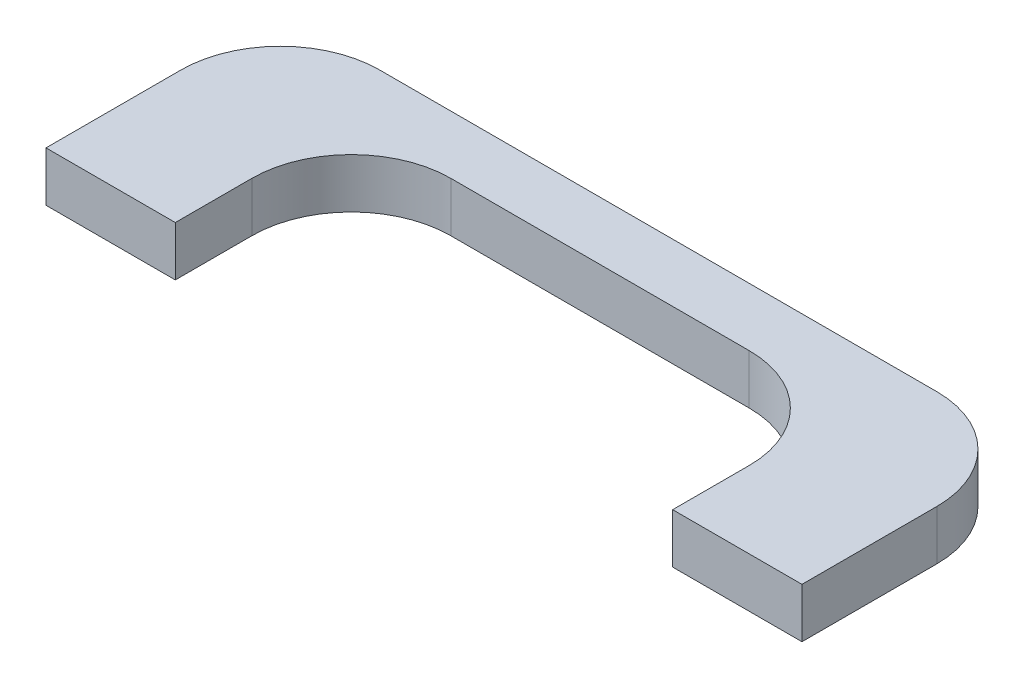
ISO-10303-21;
HEADER;
FILE_DESCRIPTION(('STEP AP214'),'2;1');
FILE_NAME('part.step','',(''),(''),'','','');
FILE_SCHEMA(('AUTOMOTIVE_DESIGN { 1 0 10303 214 1 1 1 1 }'));
ENDSEC;
DATA;
#1=APPLICATION_CONTEXT('core data for automotive mechanical design processes');
#2=APPLICATION_PROTOCOL_DEFINITION('international standard','automotive_design',2000,#1);
#3=PRODUCT_CONTEXT('',#1,'mechanical');
#4=PRODUCT('Part','Part','',(#3));
#5=PRODUCT_RELATED_PRODUCT_CATEGORY('part','',(#4));
#6=PRODUCT_DEFINITION_FORMATION('','',#4);
#7=PRODUCT_DEFINITION_CONTEXT('part definition',#1,'design');
#8=PRODUCT_DEFINITION('design','',#6,#7);
#9=PRODUCT_DEFINITION_SHAPE('','',#8);
#10=(LENGTH_UNIT() NAMED_UNIT(*) SI_UNIT(.MILLI.,.METRE.));
#11=(NAMED_UNIT(*) PLANE_ANGLE_UNIT() SI_UNIT($,.RADIAN.));
#12=(NAMED_UNIT(*) SI_UNIT($,.STERADIAN.) SOLID_ANGLE_UNIT());
#13=UNCERTAINTY_MEASURE_WITH_UNIT(LENGTH_MEASURE(1.E-05),#10,'distance_accuracy_value','');
#14=(GEOMETRIC_REPRESENTATION_CONTEXT(3) GLOBAL_UNCERTAINTY_ASSIGNED_CONTEXT((#13)) GLOBAL_UNIT_ASSIGNED_CONTEXT((#10,
#11,#12)) REPRESENTATION_CONTEXT('',''));
#15=CARTESIAN_POINT('',(0.,0.,0.));
#16=DIRECTION('',(0.,0.,1.));
#17=DIRECTION('',(1.,0.,0.));
#18=AXIS2_PLACEMENT_3D('',#15,#16,#17);
#19=CARTESIAN_POINT('',(0.,5.,0.));
#20=DIRECTION('',(1.,0.,0.));
#21=DIRECTION('',(0.,0.,-1.));
#22=AXIS2_PLACEMENT_3D('',#19,#20,#21);
#23=PLANE('',#22);
#24=DIRECTION('',(0.,0.,1.));
#25=VECTOR('',#24,1.);
#26=CARTESIAN_POINT('',(0.,0.,0.));
#27=LINE('',#26,#25);
#28=CARTESIAN_POINT('',(0.,0.,-13.5549993281563));
#29=VERTEX_POINT('',#28);
#30=CARTESIAN_POINT('',(0.,0.,0.));
#31=VERTEX_POINT('',#30);
#32=EDGE_CURVE('E157',#29,#31,#27,.T.);
#33=ORIENTED_EDGE('',*,*,#32,.T.);
#34=DIRECTION('',(0.,-1.,0.));
#35=VECTOR('',#34,1.);
#36=CARTESIAN_POINT('',(0.,5.,0.));
#37=LINE('',#36,#35);
#38=CARTESIAN_POINT('',(0.,5.,0.));
#39=VERTEX_POINT('',#38);
#40=EDGE_CURVE('E11',#39,#31,#37,.T.);
#41=ORIENTED_EDGE('',*,*,#40,.F.);
#42=DIRECTION('',(0.,0.,1.));
#43=VECTOR('',#42,1.);
#44=CARTESIAN_POINT('',(0.,5.,0.));
#45=LINE('',#44,#43);
#46=CARTESIAN_POINT('',(0.,5.,-13.5549993281563));
#47=VERTEX_POINT('',#46);
#48=EDGE_CURVE('E179',#47,#39,#45,.T.);
#49=ORIENTED_EDGE('',*,*,#48,.F.);
#50=DIRECTION('',(0.,-1.,0.));
#51=VECTOR('',#50,1.);
#52=CARTESIAN_POINT('',(0.,5.,-13.5549993281563));
#53=LINE('',#52,#51);
#54=EDGE_CURVE('E153',#47,#29,#53,.T.);
#55=ORIENTED_EDGE('',*,*,#54,.T.);
#56=EDGE_LOOP('',(#33,#41,#49,#55));
#57=FACE_BOUND('',#56,.T.);
#58=ADVANCED_FACE('F37',(#57),#23,.F.);
#59=CARTESIAN_POINT('',(0.,5.,0.));
#60=DIRECTION('',(0.,0.,-1.));
#61=DIRECTION('',(-1.,0.,0.));
#62=AXIS2_PLACEMENT_3D('',#59,#60,#61);
#63=PLANE('',#62);
#64=DIRECTION('',(1.,0.,0.));
#65=VECTOR('',#64,1.);
#66=CARTESIAN_POINT('',(0.,0.,0.));
#67=LINE('',#66,#65);
#68=CARTESIAN_POINT('',(13.,0.,0.));
#69=VERTEX_POINT('',#68);
#70=EDGE_CURVE('E160',#31,#69,#67,.T.);
#71=ORIENTED_EDGE('',*,*,#70,.T.);
#72=DIRECTION('',(0.,-1.,0.));
#73=VECTOR('',#72,1.);
#74=CARTESIAN_POINT('',(13.,5.,0.));
#75=LINE('',#74,#73);
#76=CARTESIAN_POINT('',(13.,5.,0.));
#77=VERTEX_POINT('',#76);
#78=EDGE_CURVE('E45',#77,#69,#75,.T.);
#79=ORIENTED_EDGE('',*,*,#78,.F.);
#80=DIRECTION('',(1.,0.,0.));
#81=VECTOR('',#80,1.);
#82=CARTESIAN_POINT('',(0.,5.,0.));
#83=LINE('',#82,#81);
#84=EDGE_CURVE('E108',#39,#77,#83,.T.);
#85=ORIENTED_EDGE('',*,*,#84,.F.);
#86=ORIENTED_EDGE('',*,*,#40,.T.);
#87=EDGE_LOOP('',(#71,#79,#85,#86));
#88=FACE_BOUND('',#87,.T.);
#89=ADVANCED_FACE('F257',(#88),#63,.F.);
#90=CARTESIAN_POINT('',(13.,5.,0.));
#91=DIRECTION('',(-1.,0.,0.));
#92=DIRECTION('',(0.,0.,1.));
#93=AXIS2_PLACEMENT_3D('',#90,#91,#92);
#94=PLANE('',#93);
#95=DIRECTION('',(0.,0.,-1.));
#96=VECTOR('',#95,1.);
#97=CARTESIAN_POINT('',(13.,0.,0.));
#98=LINE('',#97,#96);
#99=CARTESIAN_POINT('',(13.,0.,-7.69620519965658));
#100=VERTEX_POINT('',#99);
#101=EDGE_CURVE('E162',#69,#100,#98,.T.);
#102=ORIENTED_EDGE('',*,*,#101,.T.);
#103=DIRECTION('',(0.,-1.,0.));
#104=VECTOR('',#103,1.);
#105=CARTESIAN_POINT('',(13.,5.,-7.69620519965658));
#106=LINE('',#105,#104);
#107=CARTESIAN_POINT('',(13.,5.,-7.69620519965658));
#108=VERTEX_POINT('',#107);
#109=EDGE_CURVE('E198',#108,#100,#106,.T.);
#110=ORIENTED_EDGE('',*,*,#109,.F.);
#111=DIRECTION('',(0.,0.,-1.));
#112=VECTOR('',#111,1.);
#113=CARTESIAN_POINT('',(13.,5.,0.));
#114=LINE('',#113,#112);
#115=EDGE_CURVE('E206',#77,#108,#114,.T.);
#116=ORIENTED_EDGE('',*,*,#115,.F.);
#117=ORIENTED_EDGE('',*,*,#78,.T.);
#118=EDGE_LOOP('',(#102,#110,#116,#117));
#119=FACE_BOUND('',#118,.T.);
#120=ADVANCED_FACE('F204',(#119),#94,.F.);
#121=CARTESIAN_POINT('',(23.,5.,-7.69620519965658));
#122=DIRECTION('',(0.,-1.,0.));
#123=DIRECTION('',(0.,0.,-1.));
#124=AXIS2_PLACEMENT_3D('',#121,#122,#123);
#125=CYLINDRICAL_SURFACE('',#124,10.);
#126=CARTESIAN_POINT('',(23.,0.,-7.69620519965658));
#127=DIRECTION('',(0.,-1.,0.));
#128=DIRECTION('',(0.,0.,1.));
#129=AXIS2_PLACEMENT_3D('',#126,#127,#128);
#130=CIRCLE('',#129,10.);
#131=CARTESIAN_POINT('',(23.,0.,-17.6962051996566));
#132=VERTEX_POINT('',#131);
#133=EDGE_CURVE('E164',#100,#132,#130,.T.);
#134=ORIENTED_EDGE('',*,*,#133,.T.);
#135=DIRECTION('',(0.,-1.,0.));
#136=VECTOR('',#135,1.);
#137=CARTESIAN_POINT('',(23.,5.,-17.6962051996566));
#138=LINE('',#137,#136);
#139=CARTESIAN_POINT('',(23.,5.,-17.6962051996566));
#140=VERTEX_POINT('',#139);
#141=EDGE_CURVE('E195',#140,#132,#138,.T.);
#142=ORIENTED_EDGE('',*,*,#141,.F.);
#143=CARTESIAN_POINT('',(23.,5.,-7.69620519965658));
#144=DIRECTION('',(0.,-1.,0.));
#145=DIRECTION('',(0.,0.,1.));
#146=AXIS2_PLACEMENT_3D('',#143,#144,#145);
#147=CIRCLE('',#146,10.);
#148=EDGE_CURVE('E224',#108,#140,#147,.T.);
#149=ORIENTED_EDGE('',*,*,#148,.F.);
#150=ORIENTED_EDGE('',*,*,#109,.T.);
#151=EDGE_LOOP('',(#134,#142,#149,#150));
#152=FACE_BOUND('',#151,.T.);
#153=ADVANCED_FACE('F215',(#152),#125,.F.);
#154=CARTESIAN_POINT('',(23.,5.,-17.6962051996566));
#155=DIRECTION('',(0.,0.,-1.));
#156=DIRECTION('',(-1.,0.,0.));
#157=AXIS2_PLACEMENT_3D('',#154,#155,#156);
#158=PLANE('',#157);
#159=DIRECTION('',(1.,0.,0.));
#160=VECTOR('',#159,1.);
#161=CARTESIAN_POINT('',(23.,0.,-17.6962051996566));
#162=LINE('',#161,#160);
#163=CARTESIAN_POINT('',(53.,0.,-17.6962051996566));
#164=VERTEX_POINT('',#163);
#165=EDGE_CURVE('E166',#132,#164,#162,.T.);
#166=ORIENTED_EDGE('',*,*,#165,.T.);
#167=DIRECTION('',(0.,-1.,0.));
#168=VECTOR('',#167,1.);
#169=CARTESIAN_POINT('',(53.,5.,-17.6962051996566));
#170=LINE('',#169,#168);
#171=CARTESIAN_POINT('',(53.,5.,-17.6962051996566));
#172=VERTEX_POINT('',#171);
#173=EDGE_CURVE('E192',#172,#164,#170,.T.);
#174=ORIENTED_EDGE('',*,*,#173,.F.);
#175=DIRECTION('',(1.,0.,0.));
#176=VECTOR('',#175,1.);
#177=CARTESIAN_POINT('',(23.,5.,-17.6962051996566));
#178=LINE('',#177,#176);
#179=EDGE_CURVE('E221',#140,#172,#178,.T.);
#180=ORIENTED_EDGE('',*,*,#179,.F.);
#181=ORIENTED_EDGE('',*,*,#141,.T.);
#182=EDGE_LOOP('',(#166,#174,#180,#181));
#183=FACE_BOUND('',#182,.T.);
#184=ADVANCED_FACE('F219',(#183),#158,.F.);
#185=CARTESIAN_POINT('',(53.,5.,-7.69620519965658));
#186=DIRECTION('',(0.,-1.,0.));
#187=DIRECTION('',(0.,0.,-1.));
#188=AXIS2_PLACEMENT_3D('',#185,#186,#187);
#189=CYLINDRICAL_SURFACE('',#188,10.);
#190=CARTESIAN_POINT('',(53.,0.,-7.69620519965658));
#191=DIRECTION('',(0.,-1.,0.));
#192=DIRECTION('',(0.,0.,1.));
#193=AXIS2_PLACEMENT_3D('',#190,#191,#192);
#194=CIRCLE('',#193,10.);
#195=CARTESIAN_POINT('',(63.,0.,-7.69620519965658));
#196=VERTEX_POINT('',#195);
#197=EDGE_CURVE('E168',#164,#196,#194,.T.);
#198=ORIENTED_EDGE('',*,*,#197,.T.);
#199=DIRECTION('',(0.,-1.,0.));
#200=VECTOR('',#199,1.);
#201=CARTESIAN_POINT('',(63.,5.,-7.69620519965658));
#202=LINE('',#201,#200);
#203=CARTESIAN_POINT('',(63.,5.,-7.69620519965658));
#204=VERTEX_POINT('',#203);
#205=EDGE_CURVE('E189',#204,#196,#202,.T.);
#206=ORIENTED_EDGE('',*,*,#205,.F.);
#207=CARTESIAN_POINT('',(53.,5.,-7.69620519965658));
#208=DIRECTION('',(0.,-1.,0.));
#209=DIRECTION('',(0.,0.,1.));
#210=AXIS2_PLACEMENT_3D('',#207,#208,#209);
#211=CIRCLE('',#210,10.);
#212=EDGE_CURVE('E223',#172,#204,#211,.T.);
#213=ORIENTED_EDGE('',*,*,#212,.F.);
#214=ORIENTED_EDGE('',*,*,#173,.T.);
#215=EDGE_LOOP('',(#198,#206,#213,#214));
#216=FACE_BOUND('',#215,.T.);
#217=ADVANCED_FACE('F270',(#216),#189,.F.);
#218=CARTESIAN_POINT('',(63.,5.,-7.69620519965658));
#219=DIRECTION('',(1.,0.,0.));
#220=DIRECTION('',(0.,0.,-1.));
#221=AXIS2_PLACEMENT_3D('',#218,#219,#220);
#222=PLANE('',#221);
#223=DIRECTION('',(0.,0.,1.));
#224=VECTOR('',#223,1.);
#225=CARTESIAN_POINT('',(63.,0.,-7.69620519965658));
#226=LINE('',#225,#224);
#227=CARTESIAN_POINT('',(63.,0.,0.));
#228=VERTEX_POINT('',#227);
#229=EDGE_CURVE('E170',#196,#228,#226,.T.);
#230=ORIENTED_EDGE('',*,*,#229,.T.);
#231=DIRECTION('',(0.,-1.,0.));
#232=VECTOR('',#231,1.);
#233=CARTESIAN_POINT('',(63.,5.,0.));
#234=LINE('',#233,#232);
#235=CARTESIAN_POINT('',(63.,5.,0.));
#236=VERTEX_POINT('',#235);
#237=EDGE_CURVE('E186',#236,#228,#234,.T.);
#238=ORIENTED_EDGE('',*,*,#237,.F.);
#239=DIRECTION('',(0.,0.,1.));
#240=VECTOR('',#239,1.);
#241=CARTESIAN_POINT('',(63.,5.,-7.69620519965658));
#242=LINE('',#241,#240);
#243=EDGE_CURVE('E226',#204,#236,#242,.T.);
#244=ORIENTED_EDGE('',*,*,#243,.F.);
#245=ORIENTED_EDGE('',*,*,#205,.T.);
#246=EDGE_LOOP('',(#230,#238,#244,#245));
#247=FACE_BOUND('',#246,.T.);
#248=ADVANCED_FACE('F273',(#247),#222,.F.);
#249=CARTESIAN_POINT('',(76.,5.,0.));
#250=DIRECTION('',(0.,0.,-1.));
#251=DIRECTION('',(-1.,0.,0.));
#252=AXIS2_PLACEMENT_3D('',#249,#250,#251);
#253=PLANE('',#252);
#254=DIRECTION('',(1.,0.,0.));
#255=VECTOR('',#254,1.);
#256=CARTESIAN_POINT('',(76.,0.,0.));
#257=LINE('',#256,#255);
#258=CARTESIAN_POINT('',(76.,0.,0.));
#259=VERTEX_POINT('',#258);
#260=EDGE_CURVE('E172',#228,#259,#257,.T.);
#261=ORIENTED_EDGE('',*,*,#260,.T.);
#262=DIRECTION('',(0.,-1.,0.));
#263=VECTOR('',#262,1.);
#264=CARTESIAN_POINT('',(76.,5.,0.));
#265=LINE('',#264,#263);
#266=CARTESIAN_POINT('',(76.,5.,0.));
#267=VERTEX_POINT('',#266);
#268=EDGE_CURVE('E183',#267,#259,#265,.T.);
#269=ORIENTED_EDGE('',*,*,#268,.F.);
#270=DIRECTION('',(1.,0.,0.));
#271=VECTOR('',#270,1.);
#272=CARTESIAN_POINT('',(76.,5.,0.));
#273=LINE('',#272,#271);
#274=EDGE_CURVE('E232',#236,#267,#273,.T.);
#275=ORIENTED_EDGE('',*,*,#274,.F.);
#276=ORIENTED_EDGE('',*,*,#237,.T.);
#277=EDGE_LOOP('',(#261,#269,#275,#276));
#278=FACE_BOUND('',#277,.T.);
#279=ADVANCED_FACE('F238',(#278),#253,.F.);
#280=CARTESIAN_POINT('',(76.,5.,0.));
#281=DIRECTION('',(-1.,0.,0.));
#282=DIRECTION('',(0.,0.,1.));
#283=AXIS2_PLACEMENT_3D('',#280,#281,#282);
#284=PLANE('',#283);
#285=DIRECTION('',(0.,0.,-1.));
#286=VECTOR('',#285,1.);
#287=CARTESIAN_POINT('',(76.,0.,0.));
#288=LINE('',#287,#286);
#289=CARTESIAN_POINT('',(76.,0.,-13.5549993281563));
#290=VERTEX_POINT('',#289);
#291=EDGE_CURVE('E174',#259,#290,#288,.T.);
#292=ORIENTED_EDGE('',*,*,#291,.T.);
#293=DIRECTION('',(0.,-1.,0.));
#294=VECTOR('',#293,1.);
#295=CARTESIAN_POINT('',(76.,5.,-13.5549993281563));
#296=LINE('',#295,#294);
#297=CARTESIAN_POINT('',(76.,5.,-13.5549993281563));
#298=VERTEX_POINT('',#297);
#299=EDGE_CURVE('E148',#298,#290,#296,.T.);
#300=ORIENTED_EDGE('',*,*,#299,.F.);
#301=DIRECTION('',(0.,0.,-1.));
#302=VECTOR('',#301,1.);
#303=CARTESIAN_POINT('',(76.,5.,0.));
#304=LINE('',#303,#302);
#305=EDGE_CURVE('E139',#267,#298,#304,.T.);
#306=ORIENTED_EDGE('',*,*,#305,.F.);
#307=ORIENTED_EDGE('',*,*,#268,.T.);
#308=EDGE_LOOP('',(#292,#300,#306,#307));
#309=FACE_BOUND('',#308,.T.);
#310=ADVANCED_FACE('F242',(#309),#284,.F.);
#311=CARTESIAN_POINT('',(66.,5.,-13.5549993281563));
#312=DIRECTION('',(0.,-1.,0.));
#313=DIRECTION('',(0.,0.,-1.));
#314=AXIS2_PLACEMENT_3D('',#311,#312,#313);
#315=CYLINDRICAL_SURFACE('',#314,10.);
#316=CARTESIAN_POINT('',(66.,0.,-13.5549993281563));
#317=DIRECTION('',(0.,1.,0.));
#318=DIRECTION('',(0.,0.,-1.));
#319=AXIS2_PLACEMENT_3D('',#316,#317,#318);
#320=CIRCLE('',#319,10.);
#321=CARTESIAN_POINT('',(66.,0.,-23.5549993281563));
#322=VERTEX_POINT('',#321);
#323=EDGE_CURVE('E147',#290,#322,#320,.T.);
#324=ORIENTED_EDGE('',*,*,#323,.T.);
#325=DIRECTION('',(0.,-1.,0.));
#326=VECTOR('',#325,1.);
#327=CARTESIAN_POINT('',(66.,5.,-23.5549993281563));
#328=LINE('',#327,#326);
#329=CARTESIAN_POINT('',(66.,5.,-23.5549993281563));
#330=VERTEX_POINT('',#329);
#331=EDGE_CURVE('E144',#330,#322,#328,.T.);
#332=ORIENTED_EDGE('',*,*,#331,.F.);
#333=CARTESIAN_POINT('',(66.,5.,-13.5549993281563));
#334=DIRECTION('',(0.,1.,0.));
#335=DIRECTION('',(0.,0.,-1.));
#336=AXIS2_PLACEMENT_3D('',#333,#334,#335);
#337=CIRCLE('',#336,10.);
#338=EDGE_CURVE('E133',#298,#330,#337,.T.);
#339=ORIENTED_EDGE('',*,*,#338,.F.);
#340=ORIENTED_EDGE('',*,*,#299,.T.);
#341=EDGE_LOOP('',(#324,#332,#339,#340));
#342=FACE_BOUND('',#341,.T.);
#343=ADVANCED_FACE('F145',(#342),#315,.T.);
#344=CARTESIAN_POINT('',(10.,5.,-23.5549993281563));
#345=DIRECTION('',(0.,0.,1.));
#346=DIRECTION('',(1.,0.,0.));
#347=AXIS2_PLACEMENT_3D('',#344,#345,#346);
#348=PLANE('',#347);
#349=DIRECTION('',(-1.,0.,0.));
#350=VECTOR('',#349,1.);
#351=CARTESIAN_POINT('',(10.,0.,-23.5549993281563));
#352=LINE('',#351,#350);
#353=CARTESIAN_POINT('',(10.,0.,-23.5549993281563));
#354=VERTEX_POINT('',#353);
#355=EDGE_CURVE('E94',#322,#354,#352,.T.);
#356=ORIENTED_EDGE('',*,*,#355,.T.);
#357=DIRECTION('',(0.,-1.,0.));
#358=VECTOR('',#357,1.);
#359=CARTESIAN_POINT('',(10.,5.,-23.5549993281563));
#360=LINE('',#359,#358);
#361=CARTESIAN_POINT('',(10.,5.,-23.5549993281563));
#362=VERTEX_POINT('',#361);
#363=EDGE_CURVE('E149',#362,#354,#360,.T.);
#364=ORIENTED_EDGE('',*,*,#363,.F.);
#365=DIRECTION('',(-1.,0.,0.));
#366=VECTOR('',#365,1.);
#367=CARTESIAN_POINT('',(10.,5.,-23.5549993281563));
#368=LINE('',#367,#366);
#369=EDGE_CURVE('E137',#330,#362,#368,.T.);
#370=ORIENTED_EDGE('',*,*,#369,.F.);
#371=ORIENTED_EDGE('',*,*,#331,.T.);
#372=EDGE_LOOP('',(#356,#364,#370,#371));
#373=FACE_BOUND('',#372,.T.);
#374=ADVANCED_FACE('F151',(#373),#348,.F.);
#375=CARTESIAN_POINT('',(10.,5.,-13.5549993281563));
#376=DIRECTION('',(0.,-1.,0.));
#377=DIRECTION('',(0.,0.,-1.));
#378=AXIS2_PLACEMENT_3D('',#375,#376,#377);
#379=CYLINDRICAL_SURFACE('',#378,10.);
#380=CARTESIAN_POINT('',(10.,0.,-13.5549993281563));
#381=DIRECTION('',(0.,1.,0.));
#382=DIRECTION('',(0.,0.,1.));
#383=AXIS2_PLACEMENT_3D('',#380,#381,#382);
#384=CIRCLE('',#383,10.);
#385=EDGE_CURVE('E100',#354,#29,#384,.T.);
#386=ORIENTED_EDGE('',*,*,#385,.T.);
#387=ORIENTED_EDGE('',*,*,#54,.F.);
#388=CARTESIAN_POINT('',(10.,5.,-13.5549993281563));
#389=DIRECTION('',(0.,1.,0.));
#390=DIRECTION('',(0.,0.,1.));
#391=AXIS2_PLACEMENT_3D('',#388,#389,#390);
#392=CIRCLE('',#391,10.);
#393=EDGE_CURVE('E53',#362,#47,#392,.T.);
#394=ORIENTED_EDGE('',*,*,#393,.F.);
#395=ORIENTED_EDGE('',*,*,#363,.T.);
#396=EDGE_LOOP('',(#386,#387,#394,#395));
#397=FACE_BOUND('',#396,.T.);
#398=ADVANCED_FACE('F246',(#397),#379,.T.);
#399=CARTESIAN_POINT('',(10.,5.,-13.5549993281563));
#400=DIRECTION('',(0.,1.,0.));
#401=DIRECTION('',(0.,0.,1.));
#402=AXIS2_PLACEMENT_3D('',#399,#400,#401);
#403=PLANE('',#402);
#404=ORIENTED_EDGE('',*,*,#48,.T.);
#405=ORIENTED_EDGE('',*,*,#84,.T.);
#406=ORIENTED_EDGE('',*,*,#115,.T.);
#407=ORIENTED_EDGE('',*,*,#148,.T.);
#408=ORIENTED_EDGE('',*,*,#179,.T.);
#409=ORIENTED_EDGE('',*,*,#212,.T.);
#410=ORIENTED_EDGE('',*,*,#243,.T.);
#411=ORIENTED_EDGE('',*,*,#274,.T.);
#412=ORIENTED_EDGE('',*,*,#305,.T.);
#413=ORIENTED_EDGE('',*,*,#338,.T.);
#414=ORIENTED_EDGE('',*,*,#369,.T.);
#415=ORIENTED_EDGE('',*,*,#393,.T.);
#416=EDGE_LOOP('',(#404,#405,#406,#407,#408,#409,#410,#411,#412,#413,#414,#415));
#417=FACE_BOUND('',#416,.T.);
#418=ADVANCED_FACE('F135',(#417),#403,.T.);
#419=CARTESIAN_POINT('',(10.,0.,-13.5549993281563));
#420=DIRECTION('',(0.,1.,0.));
#421=DIRECTION('',(0.,0.,1.));
#422=AXIS2_PLACEMENT_3D('',#419,#420,#421);
#423=PLANE('',#422);
#424=ORIENTED_EDGE('',*,*,#32,.F.);
#425=ORIENTED_EDGE('',*,*,#385,.F.);
#426=ORIENTED_EDGE('',*,*,#355,.F.);
#427=ORIENTED_EDGE('',*,*,#323,.F.);
#428=ORIENTED_EDGE('',*,*,#291,.F.);
#429=ORIENTED_EDGE('',*,*,#260,.F.);
#430=ORIENTED_EDGE('',*,*,#229,.F.);
#431=ORIENTED_EDGE('',*,*,#197,.F.);
#432=ORIENTED_EDGE('',*,*,#165,.F.);
#433=ORIENTED_EDGE('',*,*,#133,.F.);
#434=ORIENTED_EDGE('',*,*,#101,.F.);
#435=ORIENTED_EDGE('',*,*,#70,.F.);
#436=EDGE_LOOP('',(#424,#425,#426,#427,#428,#429,#430,#431,#432,#433,#434,#435));
#437=FACE_BOUND('',#436,.T.);
#438=ADVANCED_FACE('F210',(#437),#423,.F.);
#439=CLOSED_SHELL('',(#58,#89,#120,#153,#184,#217,#248,#279,#310,#343,#374,#398,#418,#438));
#440=MANIFOLD_SOLID_BREP('B2',#439);
#441=ADVANCED_BREP_SHAPE_REPRESENTATION('',(#18,#440),#14);
#442=SHAPE_DEFINITION_REPRESENTATION(#9,#441);
ENDSEC;
END-ISO-10303-21;
